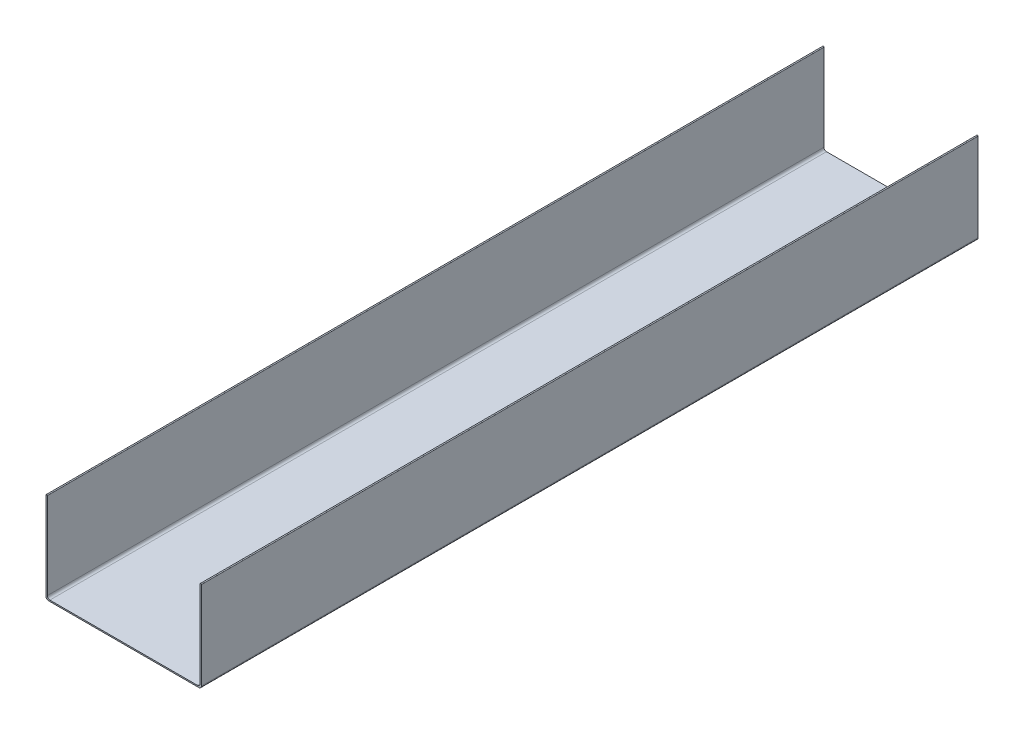
ISO-10303-21;
HEADER;
FILE_DESCRIPTION(('STEP AP214'),'2;1');
FILE_NAME('part.step','',(''),(''),'','','');
FILE_SCHEMA(('AUTOMOTIVE_DESIGN { 1 0 10303 214 1 1 1 1 }'));
ENDSEC;
DATA;
#1=APPLICATION_CONTEXT('core data for automotive mechanical design processes');
#2=APPLICATION_PROTOCOL_DEFINITION('international standard','automotive_design',2000,#1);
#3=PRODUCT_CONTEXT('',#1,'mechanical');
#4=PRODUCT('Part','Part','',(#3));
#5=PRODUCT_RELATED_PRODUCT_CATEGORY('part','',(#4));
#6=PRODUCT_DEFINITION_FORMATION('','',#4);
#7=PRODUCT_DEFINITION_CONTEXT('part definition',#1,'design');
#8=PRODUCT_DEFINITION('design','',#6,#7);
#9=PRODUCT_DEFINITION_SHAPE('','',#8);
#10=(LENGTH_UNIT() NAMED_UNIT(*) SI_UNIT(.MILLI.,.METRE.));
#11=(NAMED_UNIT(*) PLANE_ANGLE_UNIT() SI_UNIT($,.RADIAN.));
#12=(NAMED_UNIT(*) SI_UNIT($,.STERADIAN.) SOLID_ANGLE_UNIT());
#13=UNCERTAINTY_MEASURE_WITH_UNIT(LENGTH_MEASURE(1.E-05),#10,'distance_accuracy_value','');
#14=(GEOMETRIC_REPRESENTATION_CONTEXT(3) GLOBAL_UNCERTAINTY_ASSIGNED_CONTEXT((#13)) GLOBAL_UNIT_ASSIGNED_CONTEXT((#10,
#11,#12)) REPRESENTATION_CONTEXT('',''));
#15=CARTESIAN_POINT('',(0.,0.,0.));
#16=DIRECTION('',(0.,0.,1.));
#17=DIRECTION('',(1.,0.,0.));
#18=AXIS2_PLACEMENT_3D('',#15,#16,#17);
#19=CARTESIAN_POINT('',(-0.635,0.,774.7));
#20=DIRECTION('',(0.,0.,-1.));
#21=DIRECTION('',(-1.,0.,0.));
#22=AXIS2_PLACEMENT_3D('',#19,#20,#21);
#23=CYLINDRICAL_SURFACE('',#22,0.635);
#24=CARTESIAN_POINT('',(-0.635,0.,0.));
#25=DIRECTION('',(0.,0.,1.));
#26=DIRECTION('',(1.,0.,0.));
#27=AXIS2_PLACEMENT_3D('',#24,#25,#26);
#28=CIRCLE('',#27,0.635);
#29=CARTESIAN_POINT('',(0.,0.,0.));
#30=VERTEX_POINT('',#29);
#31=CARTESIAN_POINT('',(-1.27,0.,0.));
#32=VERTEX_POINT('',#31);
#33=EDGE_CURVE('E168',#30,#32,#28,.T.);
#34=ORIENTED_EDGE('',*,*,#33,.T.);
#35=DIRECTION('',(0.,0.,-1.));
#36=VECTOR('',#35,1.);
#37=CARTESIAN_POINT('',(-1.27,0.,774.7));
#38=LINE('',#37,#36);
#39=CARTESIAN_POINT('',(-1.27,0.,774.7));
#40=VERTEX_POINT('',#39);
#41=EDGE_CURVE('E11',#40,#32,#38,.T.);
#42=ORIENTED_EDGE('',*,*,#41,.F.);
#43=CARTESIAN_POINT('',(-0.635,0.,774.7));
#44=DIRECTION('',(0.,0.,1.));
#45=DIRECTION('',(1.,0.,0.));
#46=AXIS2_PLACEMENT_3D('',#43,#44,#45);
#47=CIRCLE('',#46,0.635);
#48=CARTESIAN_POINT('',(0.,0.,774.7));
#49=VERTEX_POINT('',#48);
#50=EDGE_CURVE('E202',#49,#40,#47,.T.);
#51=ORIENTED_EDGE('',*,*,#50,.F.);
#52=DIRECTION('',(0.,0.,-1.));
#53=VECTOR('',#52,1.);
#54=CARTESIAN_POINT('',(0.,0.,774.7));
#55=LINE('',#54,#53);
#56=EDGE_CURVE('E164',#49,#30,#55,.T.);
#57=ORIENTED_EDGE('',*,*,#56,.T.);
#58=EDGE_LOOP('',(#34,#42,#51,#57));
#59=FACE_BOUND('',#58,.T.);
#60=ADVANCED_FACE('F43',(#59),#23,.T.);
#61=CARTESIAN_POINT('',(-1.27,0.,774.7));
#62=DIRECTION('',(1.,0.,0.));
#63=DIRECTION('',(0.,1.,0.));
#64=AXIS2_PLACEMENT_3D('',#61,#62,#63);
#65=PLANE('',#64);
#66=DIRECTION('',(0.,-1.,0.));
#67=VECTOR('',#66,1.);
#68=CARTESIAN_POINT('',(-1.27,0.,0.));
#69=LINE('',#68,#67);
#70=CARTESIAN_POINT('',(-1.26999999999998,-87.63,0.));
#71=VERTEX_POINT('',#70);
#72=EDGE_CURVE('E172',#32,#71,#69,.T.);
#73=ORIENTED_EDGE('',*,*,#72,.T.);
#74=DIRECTION('',(0.,0.,-1.));
#75=VECTOR('',#74,1.);
#76=CARTESIAN_POINT('',(-1.26999999999998,-87.63,774.7));
#77=LINE('',#76,#75);
#78=CARTESIAN_POINT('',(-1.26999999999998,-87.63,774.7));
#79=VERTEX_POINT('',#78);
#80=EDGE_CURVE('E52',#79,#71,#77,.T.);
#81=ORIENTED_EDGE('',*,*,#80,.F.);
#82=DIRECTION('',(0.,-1.,0.));
#83=VECTOR('',#82,1.);
#84=CARTESIAN_POINT('',(-1.27,0.,774.7));
#85=LINE('',#84,#83);
#86=EDGE_CURVE('E115',#40,#79,#85,.T.);
#87=ORIENTED_EDGE('',*,*,#86,.F.);
#88=ORIENTED_EDGE('',*,*,#41,.T.);
#89=EDGE_LOOP('',(#73,#81,#87,#88));
#90=FACE_BOUND('',#89,.T.);
#91=ADVANCED_FACE('F296',(#90),#65,.F.);
#92=CARTESIAN_POINT('',(1.27000000000001,-87.63,774.7));
#93=DIRECTION('',(0.,0.,-1.));
#94=DIRECTION('',(-1.,0.,0.));
#95=AXIS2_PLACEMENT_3D('',#92,#93,#94);
#96=CYLINDRICAL_SURFACE('',#95,2.53999999999999);
#97=CARTESIAN_POINT('',(1.27000000000001,-87.63,0.));
#98=DIRECTION('',(0.,0.,1.));
#99=DIRECTION('',(1.,0.,0.));
#100=AXIS2_PLACEMENT_3D('',#97,#98,#99);
#101=CIRCLE('',#100,2.53999999999999);
#102=CARTESIAN_POINT('',(1.27000000000001,-90.17,0.));
#103=VERTEX_POINT('',#102);
#104=EDGE_CURVE('E175',#71,#103,#101,.T.);
#105=ORIENTED_EDGE('',*,*,#104,.T.);
#106=DIRECTION('',(0.,0.,-1.));
#107=VECTOR('',#106,1.);
#108=CARTESIAN_POINT('',(1.27000000000001,-90.17,774.7));
#109=LINE('',#108,#107);
#110=CARTESIAN_POINT('',(1.27000000000001,-90.17,774.7));
#111=VERTEX_POINT('',#110);
#112=EDGE_CURVE('E229',#111,#103,#109,.T.);
#113=ORIENTED_EDGE('',*,*,#112,.F.);
#114=CARTESIAN_POINT('',(1.27000000000001,-87.63,774.7));
#115=DIRECTION('',(0.,0.,1.));
#116=DIRECTION('',(1.,0.,0.));
#117=AXIS2_PLACEMENT_3D('',#114,#115,#116);
#118=CIRCLE('',#117,2.53999999999999);
#119=EDGE_CURVE('E239',#79,#111,#118,.T.);
#120=ORIENTED_EDGE('',*,*,#119,.F.);
#121=ORIENTED_EDGE('',*,*,#80,.T.);
#122=EDGE_LOOP('',(#105,#113,#120,#121));
#123=FACE_BOUND('',#122,.T.);
#124=ADVANCED_FACE('F237',(#123),#96,.T.);
#125=CARTESIAN_POINT('',(1.27000000000001,-90.17,774.7));
#126=DIRECTION('',(0.,1.,0.));
#127=DIRECTION('',(0.,0.,1.));
#128=AXIS2_PLACEMENT_3D('',#125,#126,#127);
#129=PLANE('',#128);
#130=DIRECTION('',(1.,0.,0.));
#131=VECTOR('',#130,1.);
#132=CARTESIAN_POINT('',(1.27000000000001,-90.17,0.));
#133=LINE('',#132,#131);
#134=CARTESIAN_POINT('',(151.13,-90.17,0.));
#135=VERTEX_POINT('',#134);
#136=EDGE_CURVE('E178',#103,#135,#133,.T.);
#137=ORIENTED_EDGE('',*,*,#136,.T.);
#138=DIRECTION('',(0.,0.,-1.));
#139=VECTOR('',#138,1.);
#140=CARTESIAN_POINT('',(151.13,-90.17,774.7));
#141=LINE('',#140,#139);
#142=CARTESIAN_POINT('',(151.13,-90.17,774.7));
#143=VERTEX_POINT('',#142);
#144=EDGE_CURVE('E225',#143,#135,#141,.T.);
#145=ORIENTED_EDGE('',*,*,#144,.F.);
#146=DIRECTION('',(1.,0.,0.));
#147=VECTOR('',#146,1.);
#148=CARTESIAN_POINT('',(1.27000000000001,-90.17,774.7));
#149=LINE('',#148,#147);
#150=EDGE_CURVE('E258',#111,#143,#149,.T.);
#151=ORIENTED_EDGE('',*,*,#150,.F.);
#152=ORIENTED_EDGE('',*,*,#112,.T.);
#153=EDGE_LOOP('',(#137,#145,#151,#152));
#154=FACE_BOUND('',#153,.T.);
#155=ADVANCED_FACE('F248',(#154),#129,.F.);
#156=CARTESIAN_POINT('',(151.13,-87.63,774.7));
#157=DIRECTION('',(0.,0.,-1.));
#158=DIRECTION('',(-1.,0.,0.));
#159=AXIS2_PLACEMENT_3D('',#156,#157,#158);
#160=CYLINDRICAL_SURFACE('',#159,2.53999999999997);
#161=CARTESIAN_POINT('',(151.13,-87.63,0.));
#162=DIRECTION('',(0.,0.,1.));
#163=DIRECTION('',(1.,0.,0.));
#164=AXIS2_PLACEMENT_3D('',#161,#162,#163);
#165=CIRCLE('',#164,2.53999999999997);
#166=CARTESIAN_POINT('',(153.67,-87.63,0.));
#167=VERTEX_POINT('',#166);
#168=EDGE_CURVE('E181',#135,#167,#165,.T.);
#169=ORIENTED_EDGE('',*,*,#168,.T.);
#170=DIRECTION('',(0.,0.,-1.));
#171=VECTOR('',#170,1.);
#172=CARTESIAN_POINT('',(153.67,-87.63,774.7));
#173=LINE('',#172,#171);
#174=CARTESIAN_POINT('',(153.67,-87.63,774.7));
#175=VERTEX_POINT('',#174);
#176=EDGE_CURVE('E221',#175,#167,#173,.T.);
#177=ORIENTED_EDGE('',*,*,#176,.F.);
#178=CARTESIAN_POINT('',(151.13,-87.63,774.7));
#179=DIRECTION('',(0.,0.,1.));
#180=DIRECTION('',(1.,0.,0.));
#181=AXIS2_PLACEMENT_3D('',#178,#179,#180);
#182=CIRCLE('',#181,2.53999999999997);
#183=EDGE_CURVE('E254',#143,#175,#182,.T.);
#184=ORIENTED_EDGE('',*,*,#183,.F.);
#185=ORIENTED_EDGE('',*,*,#144,.T.);
#186=EDGE_LOOP('',(#169,#177,#184,#185));
#187=FACE_BOUND('',#186,.T.);
#188=ADVANCED_FACE('F252',(#187),#160,.T.);
#189=CARTESIAN_POINT('',(153.67,-87.63,774.7));
#190=DIRECTION('',(-1.,0.,0.));
#191=DIRECTION('',(0.,-1.,0.));
#192=AXIS2_PLACEMENT_3D('',#189,#190,#191);
#193=PLANE('',#192);
#194=DIRECTION('',(0.,1.,0.));
#195=VECTOR('',#194,1.);
#196=CARTESIAN_POINT('',(153.67,-87.63,0.));
#197=LINE('',#196,#195);
#198=CARTESIAN_POINT('',(153.67,0.,0.));
#199=VERTEX_POINT('',#198);
#200=EDGE_CURVE('E184',#167,#199,#197,.T.);
#201=ORIENTED_EDGE('',*,*,#200,.T.);
#202=DIRECTION('',(0.,0.,-1.));
#203=VECTOR('',#202,1.);
#204=CARTESIAN_POINT('',(153.67,0.,774.7));
#205=LINE('',#204,#203);
#206=CARTESIAN_POINT('',(153.67,0.,774.7));
#207=VERTEX_POINT('',#206);
#208=EDGE_CURVE('E217',#207,#199,#205,.T.);
#209=ORIENTED_EDGE('',*,*,#208,.F.);
#210=DIRECTION('',(0.,1.,0.));
#211=VECTOR('',#210,1.);
#212=CARTESIAN_POINT('',(153.67,-87.63,774.7));
#213=LINE('',#212,#211);
#214=EDGE_CURVE('E257',#175,#207,#213,.T.);
#215=ORIENTED_EDGE('',*,*,#214,.F.);
#216=ORIENTED_EDGE('',*,*,#176,.T.);
#217=EDGE_LOOP('',(#201,#209,#215,#216));
#218=FACE_BOUND('',#217,.T.);
#219=ADVANCED_FACE('F309',(#218),#193,.F.);
#220=CARTESIAN_POINT('',(153.035,0.,774.7));
#221=DIRECTION('',(0.,0.,-1.));
#222=DIRECTION('',(-1.,0.,0.));
#223=AXIS2_PLACEMENT_3D('',#220,#221,#222);
#224=CYLINDRICAL_SURFACE('',#223,0.635000000000011);
#225=CARTESIAN_POINT('',(153.035,0.,0.));
#226=DIRECTION('',(0.,0.,1.));
#227=DIRECTION('',(-1.,0.,0.));
#228=AXIS2_PLACEMENT_3D('',#225,#226,#227);
#229=CIRCLE('',#228,0.635000000000011);
#230=CARTESIAN_POINT('',(152.4,0.,0.));
#231=VERTEX_POINT('',#230);
#232=EDGE_CURVE('E187',#199,#231,#229,.T.);
#233=ORIENTED_EDGE('',*,*,#232,.T.);
#234=DIRECTION('',(0.,0.,-1.));
#235=VECTOR('',#234,1.);
#236=CARTESIAN_POINT('',(152.4,0.,774.7));
#237=LINE('',#236,#235);
#238=CARTESIAN_POINT('',(152.4,0.,774.7));
#239=VERTEX_POINT('',#238);
#240=EDGE_CURVE('E213',#239,#231,#237,.T.);
#241=ORIENTED_EDGE('',*,*,#240,.F.);
#242=CARTESIAN_POINT('',(153.035,0.,774.7));
#243=DIRECTION('',(0.,0.,1.));
#244=DIRECTION('',(-1.,0.,0.));
#245=AXIS2_PLACEMENT_3D('',#242,#243,#244);
#246=CIRCLE('',#245,0.635000000000011);
#247=EDGE_CURVE('E262',#207,#239,#246,.T.);
#248=ORIENTED_EDGE('',*,*,#247,.F.);
#249=ORIENTED_EDGE('',*,*,#208,.T.);
#250=EDGE_LOOP('',(#233,#241,#248,#249));
#251=FACE_BOUND('',#250,.T.);
#252=ADVANCED_FACE('F312',(#251),#224,.T.);
#253=CARTESIAN_POINT('',(152.4,-86.36,774.7));
#254=DIRECTION('',(1.,0.,0.));
#255=DIRECTION('',(0.,1.,0.));
#256=AXIS2_PLACEMENT_3D('',#253,#254,#255);
#257=PLANE('',#256);
#258=DIRECTION('',(0.,-1.,0.));
#259=VECTOR('',#258,1.);
#260=CARTESIAN_POINT('',(152.4,-86.36,0.));
#261=LINE('',#260,#259);
#262=CARTESIAN_POINT('',(152.4,-86.36,0.));
#263=VERTEX_POINT('',#262);
#264=EDGE_CURVE('E190',#231,#263,#261,.T.);
#265=ORIENTED_EDGE('',*,*,#264,.T.);
#266=DIRECTION('',(0.,0.,-1.));
#267=VECTOR('',#266,1.);
#268=CARTESIAN_POINT('',(152.4,-86.36,774.7));
#269=LINE('',#268,#267);
#270=CARTESIAN_POINT('',(152.4,-86.36,774.7));
#271=VERTEX_POINT('',#270);
#272=EDGE_CURVE('E209',#271,#263,#269,.T.);
#273=ORIENTED_EDGE('',*,*,#272,.F.);
#274=DIRECTION('',(0.,-1.,0.));
#275=VECTOR('',#274,1.);
#276=CARTESIAN_POINT('',(152.4,-86.36,774.7));
#277=LINE('',#276,#275);
#278=EDGE_CURVE('E269',#239,#271,#277,.T.);
#279=ORIENTED_EDGE('',*,*,#278,.F.);
#280=ORIENTED_EDGE('',*,*,#240,.T.);
#281=EDGE_LOOP('',(#265,#273,#279,#280));
#282=FACE_BOUND('',#281,.T.);
#283=ADVANCED_FACE('F277',(#282),#257,.F.);
#284=CARTESIAN_POINT('',(149.86,-86.36,774.7));
#285=DIRECTION('',(0.,0.,-1.));
#286=DIRECTION('',(-1.,0.,0.));
#287=AXIS2_PLACEMENT_3D('',#284,#285,#286);
#288=CYLINDRICAL_SURFACE('',#287,2.53999999999997);
#289=CARTESIAN_POINT('',(149.86,-86.36,0.));
#290=DIRECTION('',(0.,0.,-1.));
#291=DIRECTION('',(1.,0.,0.));
#292=AXIS2_PLACEMENT_3D('',#289,#290,#291);
#293=CIRCLE('',#292,2.53999999999997);
#294=CARTESIAN_POINT('',(149.86,-88.9,0.));
#295=VERTEX_POINT('',#294);
#296=EDGE_CURVE('E193',#263,#295,#293,.T.);
#297=ORIENTED_EDGE('',*,*,#296,.T.);
#298=DIRECTION('',(0.,0.,-1.));
#299=VECTOR('',#298,1.);
#300=CARTESIAN_POINT('',(149.86,-88.9,774.7));
#301=LINE('',#300,#299);
#302=CARTESIAN_POINT('',(149.86,-88.9,774.7));
#303=VERTEX_POINT('',#302);
#304=EDGE_CURVE('E157',#303,#295,#301,.T.);
#305=ORIENTED_EDGE('',*,*,#304,.F.);
#306=CARTESIAN_POINT('',(149.86,-86.36,774.7));
#307=DIRECTION('',(0.,0.,-1.));
#308=DIRECTION('',(1.,0.,0.));
#309=AXIS2_PLACEMENT_3D('',#306,#307,#308);
#310=CIRCLE('',#309,2.53999999999997);
#311=EDGE_CURVE('E146',#271,#303,#310,.T.);
#312=ORIENTED_EDGE('',*,*,#311,.F.);
#313=ORIENTED_EDGE('',*,*,#272,.T.);
#314=EDGE_LOOP('',(#297,#305,#312,#313));
#315=FACE_BOUND('',#314,.T.);
#316=ADVANCED_FACE('F281',(#315),#288,.F.);
#317=CARTESIAN_POINT('',(2.54000000000001,-88.9,774.7));
#318=DIRECTION('',(0.,-1.,0.));
#319=DIRECTION('',(0.,0.,-1.));
#320=AXIS2_PLACEMENT_3D('',#317,#318,#319);
#321=PLANE('',#320);
#322=DIRECTION('',(-1.,0.,0.));
#323=VECTOR('',#322,1.);
#324=CARTESIAN_POINT('',(2.54000000000001,-88.9,0.));
#325=LINE('',#324,#323);
#326=CARTESIAN_POINT('',(2.54000000000001,-88.9,0.));
#327=VERTEX_POINT('',#326);
#328=EDGE_CURVE('E155',#295,#327,#325,.T.);
#329=ORIENTED_EDGE('',*,*,#328,.T.);
#330=DIRECTION('',(0.,0.,-1.));
#331=VECTOR('',#330,1.);
#332=CARTESIAN_POINT('',(2.54000000000001,-88.9,774.7));
#333=LINE('',#332,#331);
#334=CARTESIAN_POINT('',(2.54000000000001,-88.9,774.7));
#335=VERTEX_POINT('',#334);
#336=EDGE_CURVE('E152',#335,#327,#333,.T.);
#337=ORIENTED_EDGE('',*,*,#336,.F.);
#338=DIRECTION('',(-1.,0.,0.));
#339=VECTOR('',#338,1.);
#340=CARTESIAN_POINT('',(2.54000000000001,-88.9,774.7));
#341=LINE('',#340,#339);
#342=EDGE_CURVE('E140',#303,#335,#341,.T.);
#343=ORIENTED_EDGE('',*,*,#342,.F.);
#344=ORIENTED_EDGE('',*,*,#304,.T.);
#345=EDGE_LOOP('',(#329,#337,#343,#344));
#346=FACE_BOUND('',#345,.T.);
#347=ADVANCED_FACE('F153',(#346),#321,.F.);
#348=CARTESIAN_POINT('',(2.54000000000001,-86.36,774.7));
#349=DIRECTION('',(0.,0.,-1.));
#350=DIRECTION('',(-1.,0.,0.));
#351=AXIS2_PLACEMENT_3D('',#348,#349,#350);
#352=CYLINDRICAL_SURFACE('',#351,2.53999999999999);
#353=CARTESIAN_POINT('',(2.54000000000001,-86.36,0.));
#354=DIRECTION('',(0.,0.,-1.));
#355=DIRECTION('',(1.,0.,0.));
#356=AXIS2_PLACEMENT_3D('',#353,#354,#355);
#357=CIRCLE('',#356,2.53999999999999);
#358=CARTESIAN_POINT('',(0.,-86.36,0.));
#359=VERTEX_POINT('',#358);
#360=EDGE_CURVE('E101',#327,#359,#357,.T.);
#361=ORIENTED_EDGE('',*,*,#360,.T.);
#362=DIRECTION('',(0.,0.,-1.));
#363=VECTOR('',#362,1.);
#364=CARTESIAN_POINT('',(0.,-86.36,774.7));
#365=LINE('',#364,#363);
#366=CARTESIAN_POINT('',(0.,-86.36,774.7));
#367=VERTEX_POINT('',#366);
#368=EDGE_CURVE('E158',#367,#359,#365,.T.);
#369=ORIENTED_EDGE('',*,*,#368,.F.);
#370=CARTESIAN_POINT('',(2.54000000000001,-86.36,774.7));
#371=DIRECTION('',(0.,0.,-1.));
#372=DIRECTION('',(1.,0.,0.));
#373=AXIS2_PLACEMENT_3D('',#370,#371,#372);
#374=CIRCLE('',#373,2.53999999999999);
#375=EDGE_CURVE('E144',#335,#367,#374,.T.);
#376=ORIENTED_EDGE('',*,*,#375,.F.);
#377=ORIENTED_EDGE('',*,*,#336,.T.);
#378=EDGE_LOOP('',(#361,#369,#376,#377));
#379=FACE_BOUND('',#378,.T.);
#380=ADVANCED_FACE('F160',(#379),#352,.F.);
#381=CARTESIAN_POINT('',(0.,0.,774.7));
#382=DIRECTION('',(-1.,0.,0.));
#383=DIRECTION('',(0.,-1.,0.));
#384=AXIS2_PLACEMENT_3D('',#381,#382,#383);
#385=PLANE('',#384);
#386=DIRECTION('',(0.,1.,0.));
#387=VECTOR('',#386,1.);
#388=CARTESIAN_POINT('',(0.,0.,0.));
#389=LINE('',#388,#387);
#390=EDGE_CURVE('E107',#359,#30,#389,.T.);
#391=ORIENTED_EDGE('',*,*,#390,.T.);
#392=ORIENTED_EDGE('',*,*,#56,.F.);
#393=DIRECTION('',(0.,1.,0.));
#394=VECTOR('',#393,1.);
#395=CARTESIAN_POINT('',(0.,0.,774.7));
#396=LINE('',#395,#394);
#397=EDGE_CURVE('E60',#367,#49,#396,.T.);
#398=ORIENTED_EDGE('',*,*,#397,.F.);
#399=ORIENTED_EDGE('',*,*,#368,.T.);
#400=EDGE_LOOP('',(#391,#392,#398,#399));
#401=FACE_BOUND('',#400,.T.);
#402=ADVANCED_FACE('F285',(#401),#385,.F.);
#403=CARTESIAN_POINT('',(-0.635,0.,774.7));
#404=DIRECTION('',(0.,0.,1.));
#405=DIRECTION('',(1.,0.,0.));
#406=AXIS2_PLACEMENT_3D('',#403,#404,#405);
#407=PLANE('',#406);
#408=ORIENTED_EDGE('',*,*,#50,.T.);
#409=ORIENTED_EDGE('',*,*,#86,.T.);
#410=ORIENTED_EDGE('',*,*,#119,.T.);
#411=ORIENTED_EDGE('',*,*,#150,.T.);
#412=ORIENTED_EDGE('',*,*,#183,.T.);
#413=ORIENTED_EDGE('',*,*,#214,.T.);
#414=ORIENTED_EDGE('',*,*,#247,.T.);
#415=ORIENTED_EDGE('',*,*,#278,.T.);
#416=ORIENTED_EDGE('',*,*,#311,.T.);
#417=ORIENTED_EDGE('',*,*,#342,.T.);
#418=ORIENTED_EDGE('',*,*,#375,.T.);
#419=ORIENTED_EDGE('',*,*,#397,.T.);
#420=EDGE_LOOP('',(#408,#409,#410,#411,#412,#413,#414,#415,#416,#417,#418,#419));
#421=FACE_BOUND('',#420,.T.);
#422=ADVANCED_FACE('F142',(#421),#407,.T.);
#423=CARTESIAN_POINT('',(-0.635,0.,0.));
#424=DIRECTION('',(0.,0.,1.));
#425=DIRECTION('',(1.,0.,0.));
#426=AXIS2_PLACEMENT_3D('',#423,#424,#425);
#427=PLANE('',#426);
#428=ORIENTED_EDGE('',*,*,#33,.F.);
#429=ORIENTED_EDGE('',*,*,#390,.F.);
#430=ORIENTED_EDGE('',*,*,#360,.F.);
#431=ORIENTED_EDGE('',*,*,#328,.F.);
#432=ORIENTED_EDGE('',*,*,#296,.F.);
#433=ORIENTED_EDGE('',*,*,#264,.F.);
#434=ORIENTED_EDGE('',*,*,#232,.F.);
#435=ORIENTED_EDGE('',*,*,#200,.F.);
#436=ORIENTED_EDGE('',*,*,#168,.F.);
#437=ORIENTED_EDGE('',*,*,#136,.F.);
#438=ORIENTED_EDGE('',*,*,#104,.F.);
#439=ORIENTED_EDGE('',*,*,#72,.F.);
#440=EDGE_LOOP('',(#428,#429,#430,#431,#432,#433,#434,#435,#436,#437,#438,#439));
#441=FACE_BOUND('',#440,.T.);
#442=ADVANCED_FACE('F243',(#441),#427,.F.);
#443=CLOSED_SHELL('',(#60,#91,#124,#155,#188,#219,#252,#283,#316,#347,#380,#402,#422,#442));
#444=MANIFOLD_SOLID_BREP('B2',#443);
#445=ADVANCED_BREP_SHAPE_REPRESENTATION('',(#18,#444),#14);
#446=SHAPE_DEFINITION_REPRESENTATION(#9,#445);
ENDSEC;
END-ISO-10303-21;
